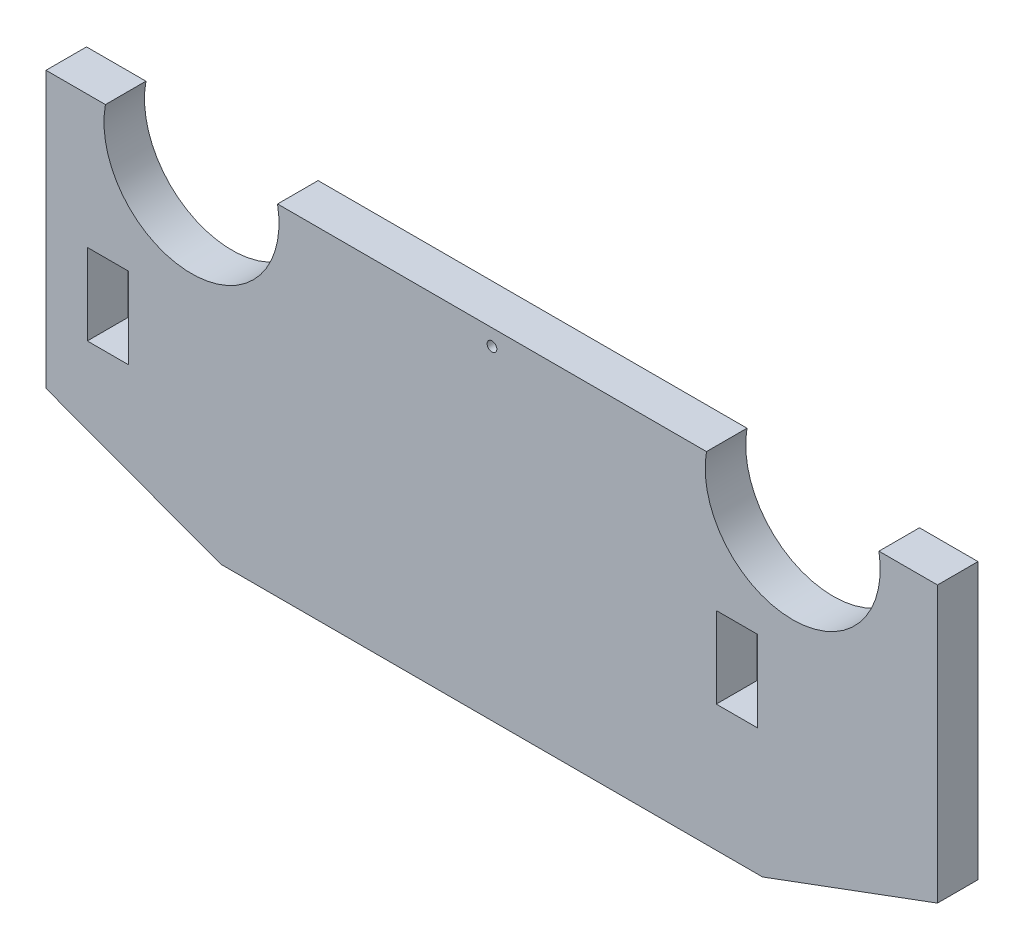
ISO-10303-21;
HEADER;
FILE_DESCRIPTION(('STEP AP214'),'2;1');
FILE_NAME('part.step','',(''),(''),'','','');
FILE_SCHEMA(('AUTOMOTIVE_DESIGN { 1 0 10303 214 1 1 1 1 }'));
ENDSEC;
DATA;
#1=APPLICATION_CONTEXT('core data for automotive mechanical design processes');
#2=APPLICATION_PROTOCOL_DEFINITION('international standard','automotive_design',2000,#1);
#3=PRODUCT_CONTEXT('',#1,'mechanical');
#4=PRODUCT('Part','Part','',(#3));
#5=PRODUCT_RELATED_PRODUCT_CATEGORY('part','',(#4));
#6=PRODUCT_DEFINITION_FORMATION('','',#4);
#7=PRODUCT_DEFINITION_CONTEXT('part definition',#1,'design');
#8=PRODUCT_DEFINITION('design','',#6,#7);
#9=PRODUCT_DEFINITION_SHAPE('','',#8);
#10=(LENGTH_UNIT() NAMED_UNIT(*) SI_UNIT(.MILLI.,.METRE.));
#11=(NAMED_UNIT(*) PLANE_ANGLE_UNIT() SI_UNIT($,.RADIAN.));
#12=(NAMED_UNIT(*) SI_UNIT($,.STERADIAN.) SOLID_ANGLE_UNIT());
#13=UNCERTAINTY_MEASURE_WITH_UNIT(LENGTH_MEASURE(1.E-05),#10,'distance_accuracy_value','');
#14=(GEOMETRIC_REPRESENTATION_CONTEXT(3) GLOBAL_UNCERTAINTY_ASSIGNED_CONTEXT((#13)) GLOBAL_UNIT_ASSIGNED_CONTEXT((#10,
#11,#12)) REPRESENTATION_CONTEXT('',''));
#15=CARTESIAN_POINT('',(0.,0.,0.));
#16=DIRECTION('',(0.,0.,1.));
#17=DIRECTION('',(1.,0.,0.));
#18=AXIS2_PLACEMENT_3D('',#15,#16,#17);
#19=CARTESIAN_POINT('',(-34.925,9.525,3.175));
#20=DIRECTION('',(0.,-1.,0.));
#21=DIRECTION('',(0.,0.,-1.));
#22=AXIS2_PLACEMENT_3D('',#19,#20,#21);
#23=PLANE('',#22);
#24=DIRECTION('',(-1.,0.,0.));
#25=VECTOR('',#24,1.);
#26=CARTESIAN_POINT('',(-34.925,9.525,0.));
#27=LINE('',#26,#25);
#28=CARTESIAN_POINT('',(34.925,9.525,0.));
#29=VERTEX_POINT('',#28);
#30=CARTESIAN_POINT('',(30.337818848547,9.525,0.));
#31=VERTEX_POINT('',#30);
#32=EDGE_CURVE('E187',#29,#31,#27,.T.);
#33=ORIENTED_EDGE('',*,*,#32,.T.);
#34=DIRECTION('',(0.,0.,1.));
#35=VECTOR('',#34,1.);
#36=CARTESIAN_POINT('',(30.337818848547,9.525,0.));
#37=LINE('',#36,#35);
#38=CARTESIAN_POINT('',(30.337818848547,9.525,3.175));
#39=VERTEX_POINT('',#38);
#40=EDGE_CURVE('E46',#31,#39,#37,.T.);
#41=ORIENTED_EDGE('',*,*,#40,.T.);
#42=DIRECTION('',(-1.,0.,0.));
#43=VECTOR('',#42,1.);
#44=CARTESIAN_POINT('',(-34.925,9.525,3.175));
#45=LINE('',#44,#43);
#46=CARTESIAN_POINT('',(34.925,9.525,3.175));
#47=VERTEX_POINT('',#46);
#48=EDGE_CURVE('E168',#47,#39,#45,.T.);
#49=ORIENTED_EDGE('',*,*,#48,.F.);
#50=DIRECTION('',(0.,0.,-1.));
#51=VECTOR('',#50,1.);
#52=CARTESIAN_POINT('',(34.925,9.525,3.175));
#53=LINE('',#52,#51);
#54=EDGE_CURVE('E194',#47,#29,#53,.T.);
#55=ORIENTED_EDGE('',*,*,#54,.T.);
#56=EDGE_LOOP('',(#33,#41,#49,#55));
#57=FACE_BOUND('',#56,.T.);
#58=ADVANCED_FACE('F32',(#57),#23,.F.);
#59=CARTESIAN_POINT('',(16.8247980446848,9.525,3.175));
#60=VERTEX_POINT('',#59);
#61=CARTESIAN_POINT('',(-16.781802364217,9.525,3.175));
#62=VERTEX_POINT('',#61);
#63=EDGE_CURVE('E165',#60,#62,#45,.T.);
#64=ORIENTED_EDGE('',*,*,#63,.F.);
#65=DIRECTION('',(0.,0.,1.));
#66=VECTOR('',#65,1.);
#67=CARTESIAN_POINT('',(16.8247980446848,9.525,0.));
#68=LINE('',#67,#66);
#69=CARTESIAN_POINT('',(16.8247980446848,9.525,0.));
#70=VERTEX_POINT('',#69);
#71=EDGE_CURVE('E155',#60,#70,#68,.F.);
#72=ORIENTED_EDGE('',*,*,#71,.T.);
#73=CARTESIAN_POINT('',(-16.781802364217,9.525,0.));
#74=VERTEX_POINT('',#73);
#75=EDGE_CURVE('E54',#70,#74,#27,.T.);
#76=ORIENTED_EDGE('',*,*,#75,.T.);
#77=DIRECTION('',(0.,0.,1.));
#78=VECTOR('',#77,1.);
#79=CARTESIAN_POINT('',(-16.781802364217,9.525,0.));
#80=LINE('',#79,#78);
#81=EDGE_CURVE('E172',#74,#62,#80,.T.);
#82=ORIENTED_EDGE('',*,*,#81,.T.);
#83=EDGE_LOOP('',(#64,#72,#76,#82));
#84=FACE_BOUND('',#83,.T.);
#85=ADVANCED_FACE('F171',(#84),#23,.F.);
#86=CARTESIAN_POINT('',(34.925,-9.525,3.175));
#87=DIRECTION('',(-1.,0.,0.));
#88=DIRECTION('',(0.,0.,1.));
#89=AXIS2_PLACEMENT_3D('',#86,#87,#88);
#90=PLANE('',#89);
#91=DIRECTION('',(0.,1.,0.));
#92=VECTOR('',#91,1.);
#93=CARTESIAN_POINT('',(34.925,-9.525,0.));
#94=LINE('',#93,#92);
#95=CARTESIAN_POINT('',(34.925,-12.065,0.));
#96=VERTEX_POINT('',#95);
#97=EDGE_CURVE('E182',#96,#29,#94,.T.);
#98=ORIENTED_EDGE('',*,*,#97,.T.);
#99=ORIENTED_EDGE('',*,*,#54,.F.);
#100=DIRECTION('',(0.,1.,0.));
#101=VECTOR('',#100,1.);
#102=CARTESIAN_POINT('',(34.925,-9.525,3.175));
#103=LINE('',#102,#101);
#104=CARTESIAN_POINT('',(34.925,-12.065,3.175));
#105=VERTEX_POINT('',#104);
#106=EDGE_CURVE('E176',#105,#47,#103,.T.);
#107=ORIENTED_EDGE('',*,*,#106,.F.);
#108=DIRECTION('',(0.,0.,1.));
#109=VECTOR('',#108,1.);
#110=CARTESIAN_POINT('',(34.925,-12.065,0.));
#111=LINE('',#110,#109);
#112=EDGE_CURVE('E233',#96,#105,#111,.T.);
#113=ORIENTED_EDGE('',*,*,#112,.F.);
#114=EDGE_LOOP('',(#98,#99,#107,#113));
#115=FACE_BOUND('',#114,.T.);
#116=ADVANCED_FACE('F34',(#115),#90,.F.);
#117=CARTESIAN_POINT('',(-30.2698721922055,9.525,3.175));
#118=VERTEX_POINT('',#117);
#119=CARTESIAN_POINT('',(-34.925,9.525,3.175));
#120=VERTEX_POINT('',#119);
#121=EDGE_CURVE('E173',#118,#120,#45,.T.);
#122=ORIENTED_EDGE('',*,*,#121,.F.);
#123=DIRECTION('',(0.,0.,1.));
#124=VECTOR('',#123,1.);
#125=CARTESIAN_POINT('',(-30.2698721922055,9.525,0.));
#126=LINE('',#125,#124);
#127=CARTESIAN_POINT('',(-30.2698721922055,9.525,0.));
#128=VERTEX_POINT('',#127);
#129=EDGE_CURVE('E200',#118,#128,#126,.F.);
#130=ORIENTED_EDGE('',*,*,#129,.T.);
#131=CARTESIAN_POINT('',(-34.925,9.525,0.));
#132=VERTEX_POINT('',#131);
#133=EDGE_CURVE('E185',#128,#132,#27,.T.);
#134=ORIENTED_EDGE('',*,*,#133,.T.);
#135=DIRECTION('',(0.,0.,-1.));
#136=VECTOR('',#135,1.);
#137=CARTESIAN_POINT('',(-34.925,9.525,3.175));
#138=LINE('',#137,#136);
#139=EDGE_CURVE('E181',#120,#132,#138,.T.);
#140=ORIENTED_EDGE('',*,*,#139,.F.);
#141=EDGE_LOOP('',(#122,#130,#134,#140));
#142=FACE_BOUND('',#141,.T.);
#143=ADVANCED_FACE('F205',(#142),#23,.F.);
#144=CARTESIAN_POINT('',(-34.925,-9.525,3.175));
#145=DIRECTION('',(1.,0.,0.));
#146=DIRECTION('',(0.,0.,-1.));
#147=AXIS2_PLACEMENT_3D('',#144,#145,#146);
#148=PLANE('',#147);
#149=DIRECTION('',(0.,-1.,0.));
#150=VECTOR('',#149,1.);
#151=CARTESIAN_POINT('',(-34.925,-9.525,0.));
#152=LINE('',#151,#150);
#153=CARTESIAN_POINT('',(-34.925,-12.065,0.));
#154=VERTEX_POINT('',#153);
#155=EDGE_CURVE('E190',#132,#154,#152,.T.);
#156=ORIENTED_EDGE('',*,*,#155,.T.);
#157=DIRECTION('',(0.,0.,1.));
#158=VECTOR('',#157,1.);
#159=CARTESIAN_POINT('',(-34.925,-12.065,0.));
#160=LINE('',#159,#158);
#161=CARTESIAN_POINT('',(-34.925,-12.065,3.175));
#162=VERTEX_POINT('',#161);
#163=EDGE_CURVE('E221',#154,#162,#160,.T.);
#164=ORIENTED_EDGE('',*,*,#163,.T.);
#165=DIRECTION('',(0.,-1.,0.));
#166=VECTOR('',#165,1.);
#167=CARTESIAN_POINT('',(-34.925,-9.525,3.175));
#168=LINE('',#167,#166);
#169=EDGE_CURVE('E175',#120,#162,#168,.T.);
#170=ORIENTED_EDGE('',*,*,#169,.F.);
#171=ORIENTED_EDGE('',*,*,#139,.T.);
#172=EDGE_LOOP('',(#156,#164,#170,#171));
#173=FACE_BOUND('',#172,.T.);
#174=ADVANCED_FACE('F219',(#173),#148,.F.);
#175=CARTESIAN_POINT('',(34.925,9.525,3.175));
#176=DIRECTION('',(0.,0.,-1.));
#177=DIRECTION('',(-1.,0.,0.));
#178=AXIS2_PLACEMENT_3D('',#175,#176,#177);
#179=PLANE('',#178);
#180=CARTESIAN_POINT('',(0.018631461536054,8.255,3.175));
#181=DIRECTION('',(0.,0.,1.));
#182=DIRECTION('',(1.,0.,0.));
#183=AXIS2_PLACEMENT_3D('',#180,#181,#182);
#184=CIRCLE('',#183,0.381);
#185=CARTESIAN_POINT('',(0.399631461536054,8.255,3.175));
#186=VERTEX_POINT('',#185);
#187=EDGE_CURVE('E314',#186,#186,#184,.T.);
#188=ORIENTED_EDGE('',*,*,#187,.F.);
#189=EDGE_LOOP('',(#188));
#190=FACE_BOUND('',#189,.T.);
#191=DIRECTION('',(-1.,0.,0.));
#192=VECTOR('',#191,1.);
#193=CARTESIAN_POINT('',(17.5928228104329,-0.875352195852146,3.175));
#194=LINE('',#193,#192);
#195=CARTESIAN_POINT('',(20.8186228104329,-0.875352195852146,3.175));
#196=VERTEX_POINT('',#195);
#197=CARTESIAN_POINT('',(17.5928228104329,-0.875352195852146,3.175));
#198=VERTEX_POINT('',#197);
#199=EDGE_CURVE('E296',#196,#198,#194,.T.);
#200=ORIENTED_EDGE('',*,*,#199,.F.);
#201=DIRECTION('',(0.,1.,0.));
#202=VECTOR('',#201,1.);
#203=CARTESIAN_POINT('',(20.8186228104329,-0.875352195852146,3.175));
#204=LINE('',#203,#202);
#205=CARTESIAN_POINT('',(20.8186228104329,-7.22535219585215,3.175));
#206=VERTEX_POINT('',#205);
#207=EDGE_CURVE('E299',#206,#196,#204,.T.);
#208=ORIENTED_EDGE('',*,*,#207,.F.);
#209=DIRECTION('',(1.,0.,0.));
#210=VECTOR('',#209,1.);
#211=CARTESIAN_POINT('',(17.5928228104329,-7.22535219585215,3.175));
#212=LINE('',#211,#210);
#213=CARTESIAN_POINT('',(17.5928228104329,-7.22535219585215,3.175));
#214=VERTEX_POINT('',#213);
#215=EDGE_CURVE('E289',#214,#206,#212,.T.);
#216=ORIENTED_EDGE('',*,*,#215,.F.);
#217=DIRECTION('',(0.,-1.,0.));
#218=VECTOR('',#217,1.);
#219=CARTESIAN_POINT('',(17.5928228104329,-0.875352195852146,3.175));
#220=LINE('',#219,#218);
#221=EDGE_CURVE('E293',#198,#214,#220,.T.);
#222=ORIENTED_EDGE('',*,*,#221,.F.);
#223=EDGE_LOOP('',(#200,#208,#216,#222));
#224=FACE_BOUND('',#223,.T.);
#225=DIRECTION('',(-1.,0.,0.));
#226=VECTOR('',#225,1.);
#227=CARTESIAN_POINT('',(-31.6890002778656,-0.875352195852147,3.175));
#228=LINE('',#227,#226);
#229=CARTESIAN_POINT('',(-28.4632002778656,-0.875352195852146,3.175));
#230=VERTEX_POINT('',#229);
#231=CARTESIAN_POINT('',(-31.6890002778656,-0.875352195852147,3.175));
#232=VERTEX_POINT('',#231);
#233=EDGE_CURVE('E264',#230,#232,#228,.T.);
#234=ORIENTED_EDGE('',*,*,#233,.F.);
#235=DIRECTION('',(0.,1.,0.));
#236=VECTOR('',#235,1.);
#237=CARTESIAN_POINT('',(-28.4632002778656,-0.875352195852147,3.175));
#238=LINE('',#237,#236);
#239=CARTESIAN_POINT('',(-28.4632002778656,-7.22535219585215,3.175));
#240=VERTEX_POINT('',#239);
#241=EDGE_CURVE('E267',#240,#230,#238,.T.);
#242=ORIENTED_EDGE('',*,*,#241,.F.);
#243=DIRECTION('',(1.,0.,0.));
#244=VECTOR('',#243,1.);
#245=CARTESIAN_POINT('',(-31.6890002778656,-7.22535219585215,3.175));
#246=LINE('',#245,#244);
#247=CARTESIAN_POINT('',(-31.6890002778656,-7.22535219585215,3.175));
#248=VERTEX_POINT('',#247);
#249=EDGE_CURVE('E257',#248,#240,#246,.T.);
#250=ORIENTED_EDGE('',*,*,#249,.F.);
#251=DIRECTION('',(0.,-1.,0.));
#252=VECTOR('',#251,1.);
#253=CARTESIAN_POINT('',(-31.6890002778656,-0.875352195852147,3.175));
#254=LINE('',#253,#252);
#255=EDGE_CURVE('E261',#232,#248,#254,.T.);
#256=ORIENTED_EDGE('',*,*,#255,.F.);
#257=EDGE_LOOP('',(#234,#242,#250,#256));
#258=FACE_BOUND('',#257,.T.);
#259=ORIENTED_EDGE('',*,*,#48,.T.);
#260=CARTESIAN_POINT('',(23.5813084466159,8.34952937571165,3.175));
#261=DIRECTION('',(0.,0.,1.));
#262=DIRECTION('',(1.,0.,0.));
#263=AXIS2_PLACEMENT_3D('',#260,#261,#262);
#264=CIRCLE('',#263,6.85799999999766);
#265=EDGE_CURVE('E158',#60,#39,#264,.T.);
#266=ORIENTED_EDGE('',*,*,#265,.F.);
#267=ORIENTED_EDGE('',*,*,#63,.T.);
#268=CARTESIAN_POINT('',(-23.5258372782112,8.2799469574375,3.175));
#269=DIRECTION('',(0.,0.,1.));
#270=DIRECTION('',(1.,0.,0.));
#271=AXIS2_PLACEMENT_3D('',#268,#269,#270);
#272=CIRCLE('',#271,6.85799999999766);
#273=EDGE_CURVE('E207',#118,#62,#272,.T.);
#274=ORIENTED_EDGE('',*,*,#273,.F.);
#275=ORIENTED_EDGE('',*,*,#121,.T.);
#276=ORIENTED_EDGE('',*,*,#169,.T.);
#277=DIRECTION('',(0.937699685695736,-0.347446829667674,0.));
#278=VECTOR('',#277,1.);
#279=CARTESIAN_POINT('',(-34.925,-12.065,3.175));
#280=LINE('',#279,#278);
#281=CARTESIAN_POINT('',(-21.2149471326576,-17.145,3.175));
#282=VERTEX_POINT('',#281);
#283=EDGE_CURVE('E226',#162,#282,#280,.T.);
#284=ORIENTED_EDGE('',*,*,#283,.T.);
#285=DIRECTION('',(1.,0.,0.));
#286=VECTOR('',#285,1.);
#287=CARTESIAN_POINT('',(-21.2149471326576,-17.145,3.175));
#288=LINE('',#287,#286);
#289=CARTESIAN_POINT('',(21.2149471326576,-17.145,3.175));
#290=VERTEX_POINT('',#289);
#291=EDGE_CURVE('E231',#282,#290,#288,.T.);
#292=ORIENTED_EDGE('',*,*,#291,.T.);
#293=DIRECTION('',(-0.937699685695736,-0.347446829667674,0.));
#294=VECTOR('',#293,1.);
#295=CARTESIAN_POINT('',(34.925,-12.065,3.175));
#296=LINE('',#295,#294);
#297=EDGE_CURVE('E242',#105,#290,#296,.T.);
#298=ORIENTED_EDGE('',*,*,#297,.F.);
#299=ORIENTED_EDGE('',*,*,#106,.T.);
#300=EDGE_LOOP('',(#259,#266,#267,#274,#275,#276,#284,#292,#298,#299));
#301=FACE_BOUND('',#300,.T.);
#302=ADVANCED_FACE('F163',(#190,#224,#258,#301),#179,.F.);
#303=CARTESIAN_POINT('',(34.925,9.525,0.));
#304=DIRECTION('',(0.,0.,-1.));
#305=DIRECTION('',(-1.,0.,0.));
#306=AXIS2_PLACEMENT_3D('',#303,#304,#305);
#307=PLANE('',#306);
#308=CARTESIAN_POINT('',(0.018631461536054,8.255,0.));
#309=DIRECTION('',(0.,0.,1.));
#310=DIRECTION('',(1.,0.,0.));
#311=AXIS2_PLACEMENT_3D('',#308,#309,#310);
#312=CIRCLE('',#311,0.381);
#313=CARTESIAN_POINT('',(0.399631461536054,8.255,0.));
#314=VERTEX_POINT('',#313);
#315=EDGE_CURVE('E169',#314,#314,#312,.T.);
#316=ORIENTED_EDGE('',*,*,#315,.T.);
#317=EDGE_LOOP('',(#316));
#318=FACE_BOUND('',#317,.T.);
#319=CARTESIAN_POINT('',(23.5813084466159,8.34952937571165,0.));
#320=DIRECTION('',(0.,0.,-1.));
#321=DIRECTION('',(-1.,0.,0.));
#322=AXIS2_PLACEMENT_3D('',#319,#320,#321);
#323=CIRCLE('',#322,6.85799999999766);
#324=EDGE_CURVE('E11',#31,#70,#323,.T.);
#325=ORIENTED_EDGE('',*,*,#324,.F.);
#326=ORIENTED_EDGE('',*,*,#32,.F.);
#327=ORIENTED_EDGE('',*,*,#97,.F.);
#328=DIRECTION('',(-0.937699685695736,-0.347446829667674,0.));
#329=VECTOR('',#328,1.);
#330=CARTESIAN_POINT('',(34.925,-12.065,0.));
#331=LINE('',#330,#329);
#332=CARTESIAN_POINT('',(21.2149471326576,-17.145,0.));
#333=VERTEX_POINT('',#332);
#334=EDGE_CURVE('E239',#96,#333,#331,.T.);
#335=ORIENTED_EDGE('',*,*,#334,.T.);
#336=DIRECTION('',(1.,0.,0.));
#337=VECTOR('',#336,1.);
#338=CARTESIAN_POINT('',(-21.2149471326576,-17.145,0.));
#339=LINE('',#338,#337);
#340=CARTESIAN_POINT('',(-21.2149471326576,-17.145,0.));
#341=VERTEX_POINT('',#340);
#342=EDGE_CURVE('E227',#341,#333,#339,.T.);
#343=ORIENTED_EDGE('',*,*,#342,.F.);
#344=DIRECTION('',(0.937699685695736,-0.347446829667674,0.));
#345=VECTOR('',#344,1.);
#346=CARTESIAN_POINT('',(-34.925,-12.065,0.));
#347=LINE('',#346,#345);
#348=EDGE_CURVE('E215',#154,#341,#347,.T.);
#349=ORIENTED_EDGE('',*,*,#348,.F.);
#350=ORIENTED_EDGE('',*,*,#155,.F.);
#351=ORIENTED_EDGE('',*,*,#133,.F.);
#352=CARTESIAN_POINT('',(-23.5258372782112,8.2799469574375,0.));
#353=DIRECTION('',(0.,0.,-1.));
#354=DIRECTION('',(-1.,0.,0.));
#355=AXIS2_PLACEMENT_3D('',#352,#353,#354);
#356=CIRCLE('',#355,6.85799999999766);
#357=EDGE_CURVE('E40',#74,#128,#356,.T.);
#358=ORIENTED_EDGE('',*,*,#357,.F.);
#359=ORIENTED_EDGE('',*,*,#75,.F.);
#360=EDGE_LOOP('',(#325,#326,#327,#335,#343,#349,#350,#351,#358,#359));
#361=FACE_BOUND('',#360,.T.);
#362=DIRECTION('',(0.,1.,0.));
#363=VECTOR('',#362,1.);
#364=CARTESIAN_POINT('',(20.8186228104329,-0.875352195852146,0.));
#365=LINE('',#364,#363);
#366=CARTESIAN_POINT('',(20.8186228104329,-7.22535219585215,0.));
#367=VERTEX_POINT('',#366);
#368=CARTESIAN_POINT('',(20.8186228104329,-0.875352195852146,0.));
#369=VERTEX_POINT('',#368);
#370=EDGE_CURVE('E292',#367,#369,#365,.T.);
#371=ORIENTED_EDGE('',*,*,#370,.T.);
#372=DIRECTION('',(-1.,0.,0.));
#373=VECTOR('',#372,1.);
#374=CARTESIAN_POINT('',(17.5928228104329,-0.875352195852146,0.));
#375=LINE('',#374,#373);
#376=CARTESIAN_POINT('',(17.5928228104329,-0.875352195852146,0.));
#377=VERTEX_POINT('',#376);
#378=EDGE_CURVE('E306',#369,#377,#375,.T.);
#379=ORIENTED_EDGE('',*,*,#378,.T.);
#380=DIRECTION('',(0.,-1.,0.));
#381=VECTOR('',#380,1.);
#382=CARTESIAN_POINT('',(17.5928228104329,-0.875352195852146,0.));
#383=LINE('',#382,#381);
#384=CARTESIAN_POINT('',(17.5928228104329,-7.22535219585215,0.));
#385=VERTEX_POINT('',#384);
#386=EDGE_CURVE('E303',#377,#385,#383,.T.);
#387=ORIENTED_EDGE('',*,*,#386,.T.);
#388=DIRECTION('',(1.,0.,0.));
#389=VECTOR('',#388,1.);
#390=CARTESIAN_POINT('',(17.5928228104329,-7.22535219585215,0.));
#391=LINE('',#390,#389);
#392=EDGE_CURVE('E284',#385,#367,#391,.T.);
#393=ORIENTED_EDGE('',*,*,#392,.T.);
#394=EDGE_LOOP('',(#371,#379,#387,#393));
#395=FACE_BOUND('',#394,.T.);
#396=DIRECTION('',(0.,1.,0.));
#397=VECTOR('',#396,1.);
#398=CARTESIAN_POINT('',(-28.4632002778656,-0.875352195852147,0.));
#399=LINE('',#398,#397);
#400=CARTESIAN_POINT('',(-28.4632002778656,-7.22535219585215,0.));
#401=VERTEX_POINT('',#400);
#402=CARTESIAN_POINT('',(-28.4632002778656,-0.875352195852147,0.));
#403=VERTEX_POINT('',#402);
#404=EDGE_CURVE('E260',#401,#403,#399,.T.);
#405=ORIENTED_EDGE('',*,*,#404,.T.);
#406=DIRECTION('',(-1.,0.,0.));
#407=VECTOR('',#406,1.);
#408=CARTESIAN_POINT('',(-31.6890002778656,-0.875352195852147,0.));
#409=LINE('',#408,#407);
#410=CARTESIAN_POINT('',(-31.6890002778656,-0.875352195852146,0.));
#411=VERTEX_POINT('',#410);
#412=EDGE_CURVE('E275',#403,#411,#409,.T.);
#413=ORIENTED_EDGE('',*,*,#412,.T.);
#414=DIRECTION('',(0.,-1.,0.));
#415=VECTOR('',#414,1.);
#416=CARTESIAN_POINT('',(-31.6890002778656,-0.875352195852147,0.));
#417=LINE('',#416,#415);
#418=CARTESIAN_POINT('',(-31.6890002778656,-7.22535219585215,0.));
#419=VERTEX_POINT('',#418);
#420=EDGE_CURVE('E272',#411,#419,#417,.T.);
#421=ORIENTED_EDGE('',*,*,#420,.T.);
#422=DIRECTION('',(1.,0.,0.));
#423=VECTOR('',#422,1.);
#424=CARTESIAN_POINT('',(-31.6890002778656,-7.22535219585215,0.));
#425=LINE('',#424,#423);
#426=EDGE_CURVE('E252',#419,#401,#425,.T.);
#427=ORIENTED_EDGE('',*,*,#426,.T.);
#428=EDGE_LOOP('',(#405,#413,#421,#427));
#429=FACE_BOUND('',#428,.T.);
#430=ADVANCED_FACE('F210',(#318,#361,#395,#429),#307,.T.);
#431=CARTESIAN_POINT('',(-21.2149471326576,-17.145,0.));
#432=DIRECTION('',(0.,-1.,0.));
#433=DIRECTION('',(0.,0.,-1.));
#434=AXIS2_PLACEMENT_3D('',#431,#432,#433);
#435=PLANE('',#434);
#436=ORIENTED_EDGE('',*,*,#291,.F.);
#437=DIRECTION('',(0.,0.,1.));
#438=VECTOR('',#437,1.);
#439=CARTESIAN_POINT('',(-21.2149471326576,-17.145,0.));
#440=LINE('',#439,#438);
#441=EDGE_CURVE('E186',#341,#282,#440,.T.);
#442=ORIENTED_EDGE('',*,*,#441,.F.);
#443=ORIENTED_EDGE('',*,*,#342,.T.);
#444=DIRECTION('',(0.,0.,1.));
#445=VECTOR('',#444,1.);
#446=CARTESIAN_POINT('',(21.2149471326576,-17.145,0.));
#447=LINE('',#446,#445);
#448=EDGE_CURVE('E236',#333,#290,#447,.T.);
#449=ORIENTED_EDGE('',*,*,#448,.T.);
#450=EDGE_LOOP('',(#436,#442,#443,#449));
#451=FACE_BOUND('',#450,.T.);
#452=ADVANCED_FACE('F352',(#451),#435,.T.);
#453=CARTESIAN_POINT('',(-34.925,-12.065,0.));
#454=DIRECTION('',(-0.347446829667674,-0.937699685695736,0.));
#455=DIRECTION('',(0.937699685695736,-0.347446829667674,0.));
#456=AXIS2_PLACEMENT_3D('',#453,#454,#455);
#457=PLANE('',#456);
#458=ORIENTED_EDGE('',*,*,#283,.F.);
#459=ORIENTED_EDGE('',*,*,#163,.F.);
#460=ORIENTED_EDGE('',*,*,#348,.T.);
#461=ORIENTED_EDGE('',*,*,#441,.T.);
#462=EDGE_LOOP('',(#458,#459,#460,#461));
#463=FACE_BOUND('',#462,.T.);
#464=ADVANCED_FACE('F224',(#463),#457,.T.);
#465=CARTESIAN_POINT('',(34.925,-12.065,0.));
#466=DIRECTION('',(-0.347446829667674,0.937699685695736,0.));
#467=DIRECTION('',(-0.937699685695736,-0.347446829667674,0.));
#468=AXIS2_PLACEMENT_3D('',#465,#466,#467);
#469=PLANE('',#468);
#470=ORIENTED_EDGE('',*,*,#297,.T.);
#471=ORIENTED_EDGE('',*,*,#448,.F.);
#472=ORIENTED_EDGE('',*,*,#334,.F.);
#473=ORIENTED_EDGE('',*,*,#112,.T.);
#474=EDGE_LOOP('',(#470,#471,#472,#473));
#475=FACE_BOUND('',#474,.T.);
#476=ADVANCED_FACE('F379',(#475),#469,.F.);
#477=CARTESIAN_POINT('',(-28.4632002778656,-0.875352195852147,0.));
#478=DIRECTION('',(1.,0.,0.));
#479=DIRECTION('',(0.,0.,-1.));
#480=AXIS2_PLACEMENT_3D('',#477,#478,#479);
#481=PLANE('',#480);
#482=ORIENTED_EDGE('',*,*,#241,.T.);
#483=DIRECTION('',(0.,0.,1.));
#484=VECTOR('',#483,1.);
#485=CARTESIAN_POINT('',(-28.4632002778656,-0.875352195852147,0.));
#486=LINE('',#485,#484);
#487=EDGE_CURVE('E248',#403,#230,#486,.T.);
#488=ORIENTED_EDGE('',*,*,#487,.F.);
#489=ORIENTED_EDGE('',*,*,#404,.F.);
#490=DIRECTION('',(0.,0.,1.));
#491=VECTOR('',#490,1.);
#492=CARTESIAN_POINT('',(-28.4632002778656,-7.22535219585215,0.));
#493=LINE('',#492,#491);
#494=EDGE_CURVE('E245',#401,#240,#493,.T.);
#495=ORIENTED_EDGE('',*,*,#494,.T.);
#496=EDGE_LOOP('',(#482,#488,#489,#495));
#497=FACE_BOUND('',#496,.T.);
#498=ADVANCED_FACE('F344',(#497),#481,.F.);
#499=CARTESIAN_POINT('',(-31.6890002778656,-7.22535219585215,0.));
#500=DIRECTION('',(0.,-1.,0.));
#501=DIRECTION('',(0.,0.,-1.));
#502=AXIS2_PLACEMENT_3D('',#499,#500,#501);
#503=PLANE('',#502);
#504=ORIENTED_EDGE('',*,*,#249,.T.);
#505=ORIENTED_EDGE('',*,*,#494,.F.);
#506=ORIENTED_EDGE('',*,*,#426,.F.);
#507=DIRECTION('',(0.,0.,1.));
#508=VECTOR('',#507,1.);
#509=CARTESIAN_POINT('',(-31.6890002778656,-7.22535219585215,0.));
#510=LINE('',#509,#508);
#511=EDGE_CURVE('E254',#419,#248,#510,.T.);
#512=ORIENTED_EDGE('',*,*,#511,.T.);
#513=EDGE_LOOP('',(#504,#505,#506,#512));
#514=FACE_BOUND('',#513,.T.);
#515=ADVANCED_FACE('F347',(#514),#503,.F.);
#516=CARTESIAN_POINT('',(-31.6890002778656,-0.875352195852147,0.));
#517=DIRECTION('',(-1.,0.,0.));
#518=DIRECTION('',(0.,0.,1.));
#519=AXIS2_PLACEMENT_3D('',#516,#517,#518);
#520=PLANE('',#519);
#521=ORIENTED_EDGE('',*,*,#255,.T.);
#522=ORIENTED_EDGE('',*,*,#511,.F.);
#523=ORIENTED_EDGE('',*,*,#420,.F.);
#524=DIRECTION('',(0.,0.,1.));
#525=VECTOR('',#524,1.);
#526=CARTESIAN_POINT('',(-31.6890002778656,-0.875352195852147,0.));
#527=LINE('',#526,#525);
#528=EDGE_CURVE('E251',#411,#232,#527,.T.);
#529=ORIENTED_EDGE('',*,*,#528,.T.);
#530=EDGE_LOOP('',(#521,#522,#523,#529));
#531=FACE_BOUND('',#530,.T.);
#532=ADVANCED_FACE('F349',(#531),#520,.F.);
#533=CARTESIAN_POINT('',(-31.6890002778656,-0.875352195852147,0.));
#534=DIRECTION('',(0.,1.,0.));
#535=DIRECTION('',(0.,0.,1.));
#536=AXIS2_PLACEMENT_3D('',#533,#534,#535);
#537=PLANE('',#536);
#538=ORIENTED_EDGE('',*,*,#233,.T.);
#539=ORIENTED_EDGE('',*,*,#528,.F.);
#540=ORIENTED_EDGE('',*,*,#412,.F.);
#541=ORIENTED_EDGE('',*,*,#487,.T.);
#542=EDGE_LOOP('',(#538,#539,#540,#541));
#543=FACE_BOUND('',#542,.T.);
#544=ADVANCED_FACE('F340',(#543),#537,.F.);
#545=CARTESIAN_POINT('',(20.8186228104329,-0.875352195852146,0.));
#546=DIRECTION('',(1.,0.,0.));
#547=DIRECTION('',(0.,0.,-1.));
#548=AXIS2_PLACEMENT_3D('',#545,#546,#547);
#549=PLANE('',#548);
#550=ORIENTED_EDGE('',*,*,#207,.T.);
#551=DIRECTION('',(0.,0.,1.));
#552=VECTOR('',#551,1.);
#553=CARTESIAN_POINT('',(20.8186228104329,-0.875352195852146,0.));
#554=LINE('',#553,#552);
#555=EDGE_CURVE('E280',#369,#196,#554,.T.);
#556=ORIENTED_EDGE('',*,*,#555,.F.);
#557=ORIENTED_EDGE('',*,*,#370,.F.);
#558=DIRECTION('',(0.,0.,1.));
#559=VECTOR('',#558,1.);
#560=CARTESIAN_POINT('',(20.8186228104329,-7.22535219585215,0.));
#561=LINE('',#560,#559);
#562=EDGE_CURVE('E269',#367,#206,#561,.T.);
#563=ORIENTED_EDGE('',*,*,#562,.T.);
#564=EDGE_LOOP('',(#550,#556,#557,#563));
#565=FACE_BOUND('',#564,.T.);
#566=ADVANCED_FACE('F392',(#565),#549,.F.);
#567=CARTESIAN_POINT('',(17.5928228104329,-7.22535219585215,0.));
#568=DIRECTION('',(0.,-1.,0.));
#569=DIRECTION('',(0.,0.,-1.));
#570=AXIS2_PLACEMENT_3D('',#567,#568,#569);
#571=PLANE('',#570);
#572=ORIENTED_EDGE('',*,*,#215,.T.);
#573=ORIENTED_EDGE('',*,*,#562,.F.);
#574=ORIENTED_EDGE('',*,*,#392,.F.);
#575=DIRECTION('',(0.,0.,1.));
#576=VECTOR('',#575,1.);
#577=CARTESIAN_POINT('',(17.5928228104329,-7.22535219585215,0.));
#578=LINE('',#577,#576);
#579=EDGE_CURVE('E286',#385,#214,#578,.T.);
#580=ORIENTED_EDGE('',*,*,#579,.T.);
#581=EDGE_LOOP('',(#572,#573,#574,#580));
#582=FACE_BOUND('',#581,.T.);
#583=ADVANCED_FACE('F399',(#582),#571,.F.);
#584=CARTESIAN_POINT('',(17.5928228104329,-0.875352195852146,0.));
#585=DIRECTION('',(-1.,0.,0.));
#586=DIRECTION('',(0.,0.,1.));
#587=AXIS2_PLACEMENT_3D('',#584,#585,#586);
#588=PLANE('',#587);
#589=ORIENTED_EDGE('',*,*,#221,.T.);
#590=ORIENTED_EDGE('',*,*,#579,.F.);
#591=ORIENTED_EDGE('',*,*,#386,.F.);
#592=DIRECTION('',(0.,0.,1.));
#593=VECTOR('',#592,1.);
#594=CARTESIAN_POINT('',(17.5928228104329,-0.875352195852146,0.));
#595=LINE('',#594,#593);
#596=EDGE_CURVE('E283',#377,#198,#595,.T.);
#597=ORIENTED_EDGE('',*,*,#596,.T.);
#598=EDGE_LOOP('',(#589,#590,#591,#597));
#599=FACE_BOUND('',#598,.T.);
#600=ADVANCED_FACE('F404',(#599),#588,.F.);
#601=CARTESIAN_POINT('',(17.5928228104329,-0.875352195852146,0.));
#602=DIRECTION('',(0.,1.,0.));
#603=DIRECTION('',(0.,0.,1.));
#604=AXIS2_PLACEMENT_3D('',#601,#602,#603);
#605=PLANE('',#604);
#606=ORIENTED_EDGE('',*,*,#199,.T.);
#607=ORIENTED_EDGE('',*,*,#596,.F.);
#608=ORIENTED_EDGE('',*,*,#378,.F.);
#609=ORIENTED_EDGE('',*,*,#555,.T.);
#610=EDGE_LOOP('',(#606,#607,#608,#609));
#611=FACE_BOUND('',#610,.T.);
#612=ADVANCED_FACE('F401',(#611),#605,.F.);
#613=CARTESIAN_POINT('',(-23.5258372782112,8.2799469574375,0.));
#614=DIRECTION('',(0.,0.,1.));
#615=DIRECTION('',(1.,0.,0.));
#616=AXIS2_PLACEMENT_3D('',#613,#614,#615);
#617=CYLINDRICAL_SURFACE('',#616,6.85799999999766);
#618=ORIENTED_EDGE('',*,*,#357,.T.);
#619=ORIENTED_EDGE('',*,*,#129,.F.);
#620=ORIENTED_EDGE('',*,*,#273,.T.);
#621=ORIENTED_EDGE('',*,*,#81,.F.);
#622=EDGE_LOOP('',(#618,#619,#620,#621));
#623=FACE_BOUND('',#622,.T.);
#624=ADVANCED_FACE('F199',(#623),#617,.F.);
#625=CARTESIAN_POINT('',(23.5813084466159,8.34952937571165,0.));
#626=DIRECTION('',(0.,0.,1.));
#627=DIRECTION('',(1.,0.,0.));
#628=AXIS2_PLACEMENT_3D('',#625,#626,#627);
#629=CYLINDRICAL_SURFACE('',#628,6.85799999999766);
#630=ORIENTED_EDGE('',*,*,#324,.T.);
#631=ORIENTED_EDGE('',*,*,#71,.F.);
#632=ORIENTED_EDGE('',*,*,#265,.T.);
#633=ORIENTED_EDGE('',*,*,#40,.F.);
#634=EDGE_LOOP('',(#630,#631,#632,#633));
#635=FACE_BOUND('',#634,.T.);
#636=ADVANCED_FACE('F157',(#635),#629,.F.);
#637=CARTESIAN_POINT('',(0.018631461536054,8.255,0.));
#638=DIRECTION('',(0.,0.,1.));
#639=DIRECTION('',(1.,0.,0.));
#640=AXIS2_PLACEMENT_3D('',#637,#638,#639);
#641=CYLINDRICAL_SURFACE('',#640,0.381);
#642=ORIENTED_EDGE('',*,*,#315,.F.);
#643=EDGE_LOOP('',(#642));
#644=FACE_BOUND('',#643,.T.);
#645=ORIENTED_EDGE('',*,*,#187,.T.);
#646=EDGE_LOOP('',(#645));
#647=FACE_BOUND('',#646,.T.);
#648=ADVANCED_FACE('F321',(#644,#647),#641,.F.);
#649=CLOSED_SHELL('',(#58,#85,#116,#143,#174,#302,#430,#452,#464,#476,#498,#515,#532,#544,#566,
#583,#600,#612,#624,#636,#648));
#650=MANIFOLD_SOLID_BREP('B2',#649);
#651=ADVANCED_BREP_SHAPE_REPRESENTATION('',(#18,#650),#14);
#652=SHAPE_DEFINITION_REPRESENTATION(#9,#651);
ENDSEC;
END-ISO-10303-21;
